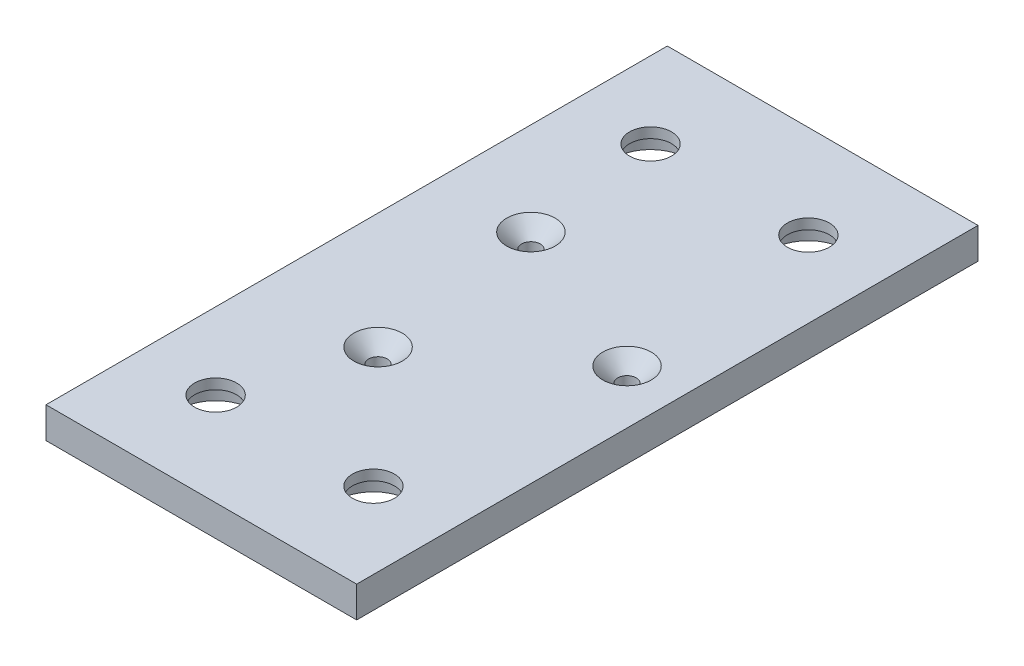
ISO-10303-21;
HEADER;
FILE_DESCRIPTION(('STEP AP214'),'2;1');
FILE_NAME('part.step','',(''),(''),'','','');
FILE_SCHEMA(('AUTOMOTIVE_DESIGN { 1 0 10303 214 1 1 1 1 }'));
ENDSEC;
DATA;
#1=APPLICATION_CONTEXT('core data for automotive mechanical design processes');
#2=APPLICATION_PROTOCOL_DEFINITION('international standard','automotive_design',2000,#1);
#3=PRODUCT_CONTEXT('',#1,'mechanical');
#4=PRODUCT('Part','Part','',(#3));
#5=PRODUCT_RELATED_PRODUCT_CATEGORY('part','',(#4));
#6=PRODUCT_DEFINITION_FORMATION('','',#4);
#7=PRODUCT_DEFINITION_CONTEXT('part definition',#1,'design');
#8=PRODUCT_DEFINITION('design','',#6,#7);
#9=PRODUCT_DEFINITION_SHAPE('','',#8);
#10=(LENGTH_UNIT() NAMED_UNIT(*) SI_UNIT(.MILLI.,.METRE.));
#11=(NAMED_UNIT(*) PLANE_ANGLE_UNIT() SI_UNIT($,.RADIAN.));
#12=(NAMED_UNIT(*) SI_UNIT($,.STERADIAN.) SOLID_ANGLE_UNIT());
#13=UNCERTAINTY_MEASURE_WITH_UNIT(LENGTH_MEASURE(1.E-05),#10,'distance_accuracy_value','');
#14=(GEOMETRIC_REPRESENTATION_CONTEXT(3) GLOBAL_UNCERTAINTY_ASSIGNED_CONTEXT((#13)) GLOBAL_UNIT_ASSIGNED_CONTEXT((#10,
#11,#12)) REPRESENTATION_CONTEXT('',''));
#15=CARTESIAN_POINT('',(0.,0.,0.));
#16=DIRECTION('',(0.,0.,1.));
#17=DIRECTION('',(1.,0.,0.));
#18=AXIS2_PLACEMENT_3D('',#15,#16,#17);
#19=CARTESIAN_POINT('',(25.,5.,50.));
#20=DIRECTION('',(-1.,0.,0.));
#21=DIRECTION('',(0.,0.,1.));
#22=AXIS2_PLACEMENT_3D('',#19,#20,#21);
#23=PLANE('',#22);
#24=DIRECTION('',(0.,0.,-1.));
#25=VECTOR('',#24,1.);
#26=CARTESIAN_POINT('',(25.,0.,50.));
#27=LINE('',#26,#25);
#28=CARTESIAN_POINT('',(25.,0.,50.));
#29=VERTEX_POINT('',#28);
#30=CARTESIAN_POINT('',(25.,0.,-50.));
#31=VERTEX_POINT('',#30);
#32=EDGE_CURVE('E100',#29,#31,#27,.T.);
#33=ORIENTED_EDGE('',*,*,#32,.T.);
#34=DIRECTION('',(0.,-1.,0.));
#35=VECTOR('',#34,1.);
#36=CARTESIAN_POINT('',(25.,5.,-50.));
#37=LINE('',#36,#35);
#38=CARTESIAN_POINT('',(25.,5.,-50.));
#39=VERTEX_POINT('',#38);
#40=EDGE_CURVE('E91',#39,#31,#37,.T.);
#41=ORIENTED_EDGE('',*,*,#40,.F.);
#42=DIRECTION('',(0.,0.,-1.));
#43=VECTOR('',#42,1.);
#44=CARTESIAN_POINT('',(25.,5.,50.));
#45=LINE('',#44,#43);
#46=CARTESIAN_POINT('',(25.,5.,50.));
#47=VERTEX_POINT('',#46);
#48=EDGE_CURVE('E85',#47,#39,#45,.T.);
#49=ORIENTED_EDGE('',*,*,#48,.F.);
#50=DIRECTION('',(0.,-1.,0.));
#51=VECTOR('',#50,1.);
#52=CARTESIAN_POINT('',(25.,5.,50.));
#53=LINE('',#52,#51);
#54=EDGE_CURVE('E96',#47,#29,#53,.T.);
#55=ORIENTED_EDGE('',*,*,#54,.T.);
#56=EDGE_LOOP('',(#33,#41,#49,#55));
#57=FACE_BOUND('',#56,.T.);
#58=ADVANCED_FACE('F32',(#57),#23,.F.);
#59=CARTESIAN_POINT('',(-25.,5.,-50.));
#60=DIRECTION('',(0.,0.,1.));
#61=DIRECTION('',(1.,0.,0.));
#62=AXIS2_PLACEMENT_3D('',#59,#60,#61);
#63=PLANE('',#62);
#64=DIRECTION('',(-1.,0.,0.));
#65=VECTOR('',#64,1.);
#66=CARTESIAN_POINT('',(-25.,0.,-50.));
#67=LINE('',#66,#65);
#68=CARTESIAN_POINT('',(-25.,0.,-50.));
#69=VERTEX_POINT('',#68);
#70=EDGE_CURVE('E90',#31,#69,#67,.T.);
#71=ORIENTED_EDGE('',*,*,#70,.T.);
#72=DIRECTION('',(0.,-1.,0.));
#73=VECTOR('',#72,1.);
#74=CARTESIAN_POINT('',(-25.,5.,-50.));
#75=LINE('',#74,#73);
#76=CARTESIAN_POINT('',(-25.,5.,-50.));
#77=VERTEX_POINT('',#76);
#78=EDGE_CURVE('E88',#77,#69,#75,.T.);
#79=ORIENTED_EDGE('',*,*,#78,.F.);
#80=DIRECTION('',(-1.,0.,0.));
#81=VECTOR('',#80,1.);
#82=CARTESIAN_POINT('',(-25.,5.,-50.));
#83=LINE('',#82,#81);
#84=EDGE_CURVE('E80',#39,#77,#83,.T.);
#85=ORIENTED_EDGE('',*,*,#84,.F.);
#86=ORIENTED_EDGE('',*,*,#40,.T.);
#87=EDGE_LOOP('',(#71,#79,#85,#86));
#88=FACE_BOUND('',#87,.T.);
#89=ADVANCED_FACE('F89',(#88),#63,.F.);
#90=CARTESIAN_POINT('',(-25.,5.,50.));
#91=DIRECTION('',(1.,0.,0.));
#92=DIRECTION('',(0.,0.,-1.));
#93=AXIS2_PLACEMENT_3D('',#90,#91,#92);
#94=PLANE('',#93);
#95=DIRECTION('',(0.,0.,1.));
#96=VECTOR('',#95,1.);
#97=CARTESIAN_POINT('',(-25.,0.,50.));
#98=LINE('',#97,#96);
#99=CARTESIAN_POINT('',(-25.,0.,50.));
#100=VERTEX_POINT('',#99);
#101=EDGE_CURVE('E66',#69,#100,#98,.T.);
#102=ORIENTED_EDGE('',*,*,#101,.T.);
#103=DIRECTION('',(0.,-1.,0.));
#104=VECTOR('',#103,1.);
#105=CARTESIAN_POINT('',(-25.,5.,50.));
#106=LINE('',#105,#104);
#107=CARTESIAN_POINT('',(-25.,5.,50.));
#108=VERTEX_POINT('',#107);
#109=EDGE_CURVE('E92',#108,#100,#106,.T.);
#110=ORIENTED_EDGE('',*,*,#109,.F.);
#111=DIRECTION('',(0.,0.,1.));
#112=VECTOR('',#111,1.);
#113=CARTESIAN_POINT('',(-25.,5.,50.));
#114=LINE('',#113,#112);
#115=EDGE_CURVE('E83',#77,#108,#114,.T.);
#116=ORIENTED_EDGE('',*,*,#115,.F.);
#117=ORIENTED_EDGE('',*,*,#78,.T.);
#118=EDGE_LOOP('',(#102,#110,#116,#117));
#119=FACE_BOUND('',#118,.T.);
#120=ADVANCED_FACE('F94',(#119),#94,.F.);
#121=CARTESIAN_POINT('',(-25.,5.,50.));
#122=DIRECTION('',(0.,0.,-1.));
#123=DIRECTION('',(-1.,0.,0.));
#124=AXIS2_PLACEMENT_3D('',#121,#122,#123);
#125=PLANE('',#124);
#126=DIRECTION('',(1.,0.,0.));
#127=VECTOR('',#126,1.);
#128=CARTESIAN_POINT('',(-25.,0.,50.));
#129=LINE('',#128,#127);
#130=EDGE_CURVE('E72',#100,#29,#129,.T.);
#131=ORIENTED_EDGE('',*,*,#130,.T.);
#132=ORIENTED_EDGE('',*,*,#54,.F.);
#133=DIRECTION('',(1.,0.,0.));
#134=VECTOR('',#133,1.);
#135=CARTESIAN_POINT('',(-25.,5.,50.));
#136=LINE('',#135,#134);
#137=EDGE_CURVE('E49',#108,#47,#136,.T.);
#138=ORIENTED_EDGE('',*,*,#137,.F.);
#139=ORIENTED_EDGE('',*,*,#109,.T.);
#140=EDGE_LOOP('',(#131,#132,#138,#139));
#141=FACE_BOUND('',#140,.T.);
#142=ADVANCED_FACE('F151',(#141),#125,.F.);
#143=CARTESIAN_POINT('',(0.,5.,0.));
#144=DIRECTION('',(0.,-1.,0.));
#145=DIRECTION('',(0.,0.,-1.));
#146=AXIS2_PLACEMENT_3D('',#143,#144,#145);
#147=PLANE('',#146);
#148=CARTESIAN_POINT('',(-12.7,5.,35.));
#149=DIRECTION('',(0.,-1.,0.));
#150=DIRECTION('',(0.,0.,-1.));
#151=AXIS2_PLACEMENT_3D('',#148,#149,#150);
#152=CIRCLE('',#151,3.3782);
#153=CARTESIAN_POINT('',(-12.7,5.,31.6218));
#154=VERTEX_POINT('',#153);
#155=EDGE_CURVE('E231',#154,#154,#152,.T.);
#156=ORIENTED_EDGE('',*,*,#155,.T.);
#157=EDGE_LOOP('',(#156));
#158=FACE_BOUND('',#157,.T.);
#159=CARTESIAN_POINT('',(12.7,5.,35.));
#160=DIRECTION('',(0.,-1.,0.));
#161=DIRECTION('',(0.,0.,-1.));
#162=AXIS2_PLACEMENT_3D('',#159,#160,#161);
#163=CIRCLE('',#162,3.3782);
#164=CARTESIAN_POINT('',(12.7,5.,31.6218));
#165=VERTEX_POINT('',#164);
#166=EDGE_CURVE('E243',#165,#165,#163,.T.);
#167=ORIENTED_EDGE('',*,*,#166,.T.);
#168=EDGE_LOOP('',(#167));
#169=FACE_BOUND('',#168,.T.);
#170=CARTESIAN_POINT('',(12.7,5.,-35.));
#171=DIRECTION('',(0.,-1.,0.));
#172=DIRECTION('',(0.,0.,-1.));
#173=AXIS2_PLACEMENT_3D('',#170,#171,#172);
#174=CIRCLE('',#173,3.3782);
#175=CARTESIAN_POINT('',(12.7,5.,-38.3782));
#176=VERTEX_POINT('',#175);
#177=EDGE_CURVE('E255',#176,#176,#174,.T.);
#178=ORIENTED_EDGE('',*,*,#177,.T.);
#179=EDGE_LOOP('',(#178));
#180=FACE_BOUND('',#179,.T.);
#181=CARTESIAN_POINT('',(-12.7,5.,-35.));
#182=DIRECTION('',(0.,-1.,0.));
#183=DIRECTION('',(0.,0.,-1.));
#184=AXIS2_PLACEMENT_3D('',#181,#182,#183);
#185=CIRCLE('',#184,3.3782);
#186=CARTESIAN_POINT('',(-12.7,5.,-38.3782));
#187=VERTEX_POINT('',#186);
#188=EDGE_CURVE('E267',#187,#187,#185,.T.);
#189=ORIENTED_EDGE('',*,*,#188,.T.);
#190=EDGE_LOOP('',(#189));
#191=FACE_BOUND('',#190,.T.);
#192=CARTESIAN_POINT('',(-6.31427663402399,5.,15.2440122864362));
#193=DIRECTION('',(0.,-1.,0.));
#194=DIRECTION('',(0.,0.,-1.));
#195=AXIS2_PLACEMENT_3D('',#192,#193,#194);
#196=CIRCLE('',#195,3.90000000000003);
#197=CARTESIAN_POINT('',(-6.31427663402399,5.,11.3440122864362));
#198=VERTEX_POINT('',#197);
#199=EDGE_CURVE('E119',#198,#198,#196,.T.);
#200=ORIENTED_EDGE('',*,*,#199,.T.);
#201=EDGE_LOOP('',(#200));
#202=FACE_BOUND('',#201,.T.);
#203=CARTESIAN_POINT('',(16.3588402126679,5.,-2.15368217163092));
#204=DIRECTION('',(0.,-1.,0.));
#205=DIRECTION('',(0.,0.,-1.));
#206=AXIS2_PLACEMENT_3D('',#203,#204,#205);
#207=CIRCLE('',#206,3.90000000000003);
#208=CARTESIAN_POINT('',(16.3588402126679,5.,-6.05368217163095));
#209=VERTEX_POINT('',#208);
#210=EDGE_CURVE('E116',#209,#209,#207,.T.);
#211=ORIENTED_EDGE('',*,*,#210,.T.);
#212=EDGE_LOOP('',(#211));
#213=FACE_BOUND('',#212,.T.);
#214=CARTESIAN_POINT('',(-10.0445635786438,5.,-13.0903301148054));
#215=DIRECTION('',(0.,-1.,0.));
#216=DIRECTION('',(0.,0.,-1.));
#217=AXIS2_PLACEMENT_3D('',#214,#215,#216);
#218=CIRCLE('',#217,3.90000000000003);
#219=CARTESIAN_POINT('',(-10.0445635786438,5.,-16.9903301148055));
#220=VERTEX_POINT('',#219);
#221=EDGE_CURVE('E113',#220,#220,#218,.T.);
#222=ORIENTED_EDGE('',*,*,#221,.T.);
#223=EDGE_LOOP('',(#222));
#224=FACE_BOUND('',#223,.T.);
#225=ORIENTED_EDGE('',*,*,#48,.T.);
#226=ORIENTED_EDGE('',*,*,#84,.T.);
#227=ORIENTED_EDGE('',*,*,#115,.T.);
#228=ORIENTED_EDGE('',*,*,#137,.T.);
#229=EDGE_LOOP('',(#225,#226,#227,#228));
#230=FACE_BOUND('',#229,.T.);
#231=ADVANCED_FACE('F81',(#158,#169,#180,#191,#202,#213,#224,#230),#147,.F.);
#232=CARTESIAN_POINT('',(0.,0.,0.));
#233=DIRECTION('',(0.,-1.,0.));
#234=DIRECTION('',(0.,0.,-1.));
#235=AXIS2_PLACEMENT_3D('',#232,#233,#234);
#236=PLANE('',#235);
#237=CARTESIAN_POINT('',(-12.7,0.,35.));
#238=DIRECTION('',(0.,-1.,0.));
#239=DIRECTION('',(0.,0.,-1.));
#240=AXIS2_PLACEMENT_3D('',#237,#238,#239);
#241=CIRCLE('',#240,5.95376);
#242=CARTESIAN_POINT('',(-12.7,0.,29.04624));
#243=VERTEX_POINT('',#242);
#244=EDGE_CURVE('E224',#243,#243,#241,.T.);
#245=ORIENTED_EDGE('',*,*,#244,.F.);
#246=EDGE_LOOP('',(#245));
#247=FACE_BOUND('',#246,.T.);
#248=CARTESIAN_POINT('',(12.7,0.,35.));
#249=DIRECTION('',(0.,-1.,0.));
#250=DIRECTION('',(0.,0.,-1.));
#251=AXIS2_PLACEMENT_3D('',#248,#249,#250);
#252=CIRCLE('',#251,5.95376);
#253=CARTESIAN_POINT('',(12.7,0.,29.04624));
#254=VERTEX_POINT('',#253);
#255=EDGE_CURVE('E234',#254,#254,#252,.T.);
#256=ORIENTED_EDGE('',*,*,#255,.F.);
#257=EDGE_LOOP('',(#256));
#258=FACE_BOUND('',#257,.T.);
#259=CARTESIAN_POINT('',(12.7,0.,-35.));
#260=DIRECTION('',(0.,-1.,0.));
#261=DIRECTION('',(0.,0.,-1.));
#262=AXIS2_PLACEMENT_3D('',#259,#260,#261);
#263=CIRCLE('',#262,5.95376);
#264=CARTESIAN_POINT('',(12.7,0.,-40.95376));
#265=VERTEX_POINT('',#264);
#266=EDGE_CURVE('E246',#265,#265,#263,.T.);
#267=ORIENTED_EDGE('',*,*,#266,.F.);
#268=EDGE_LOOP('',(#267));
#269=FACE_BOUND('',#268,.T.);
#270=CARTESIAN_POINT('',(-12.7,0.,-35.));
#271=DIRECTION('',(0.,-1.,0.));
#272=DIRECTION('',(0.,0.,-1.));
#273=AXIS2_PLACEMENT_3D('',#270,#271,#272);
#274=CIRCLE('',#273,5.95376);
#275=CARTESIAN_POINT('',(-12.7,0.,-40.95376));
#276=VERTEX_POINT('',#275);
#277=EDGE_CURVE('E258',#276,#276,#274,.T.);
#278=ORIENTED_EDGE('',*,*,#277,.F.);
#279=EDGE_LOOP('',(#278));
#280=FACE_BOUND('',#279,.T.);
#281=CARTESIAN_POINT('',(-10.0445635786438,0.,-13.0903301148054));
#282=DIRECTION('',(0.,1.,0.));
#283=DIRECTION('',(0.,0.,1.));
#284=AXIS2_PLACEMENT_3D('',#281,#282,#283);
#285=CIRCLE('',#284,1.5);
#286=CARTESIAN_POINT('',(-10.0445635786438,0.,-11.5903301148054));
#287=VERTEX_POINT('',#286);
#288=EDGE_CURVE('E270',#287,#287,#285,.T.);
#289=ORIENTED_EDGE('',*,*,#288,.T.);
#290=EDGE_LOOP('',(#289));
#291=FACE_BOUND('',#290,.T.);
#292=CARTESIAN_POINT('',(16.3588402126679,0.,-2.15368217163092));
#293=DIRECTION('',(0.,1.,0.));
#294=DIRECTION('',(0.,0.,1.));
#295=AXIS2_PLACEMENT_3D('',#292,#293,#294);
#296=CIRCLE('',#295,1.5);
#297=CARTESIAN_POINT('',(16.3588402126679,0.,-0.653682171630918));
#298=VERTEX_POINT('',#297);
#299=EDGE_CURVE('E273',#298,#298,#296,.T.);
#300=ORIENTED_EDGE('',*,*,#299,.T.);
#301=EDGE_LOOP('',(#300));
#302=FACE_BOUND('',#301,.T.);
#303=CARTESIAN_POINT('',(-6.31427663402399,0.,15.2440122864362));
#304=DIRECTION('',(0.,1.,0.));
#305=DIRECTION('',(0.,0.,1.));
#306=AXIS2_PLACEMENT_3D('',#303,#304,#305);
#307=CIRCLE('',#306,1.5);
#308=CARTESIAN_POINT('',(-6.31427663402399,0.,16.7440122864362));
#309=VERTEX_POINT('',#308);
#310=EDGE_CURVE('E103',#309,#309,#307,.T.);
#311=ORIENTED_EDGE('',*,*,#310,.T.);
#312=EDGE_LOOP('',(#311));
#313=FACE_BOUND('',#312,.T.);
#314=ORIENTED_EDGE('',*,*,#32,.F.);
#315=ORIENTED_EDGE('',*,*,#130,.F.);
#316=ORIENTED_EDGE('',*,*,#101,.F.);
#317=ORIENTED_EDGE('',*,*,#70,.F.);
#318=EDGE_LOOP('',(#314,#315,#316,#317));
#319=FACE_BOUND('',#318,.T.);
#320=ADVANCED_FACE('F154',(#247,#258,#269,#280,#291,#302,#313,#319),#236,.T.);
#321=CARTESIAN_POINT('',(-6.31427663402399,0.,15.2440122864362));
#322=DIRECTION('',(0.,1.,0.));
#323=DIRECTION('',(0.,0.,1.));
#324=AXIS2_PLACEMENT_3D('',#321,#322,#323);
#325=CYLINDRICAL_SURFACE('',#324,1.5);
#326=CARTESIAN_POINT('',(-6.31427663402399,2.59999999999999,15.2440122864362));
#327=DIRECTION('',(0.,-1.,0.));
#328=DIRECTION('',(0.,0.,-1.));
#329=AXIS2_PLACEMENT_3D('',#326,#327,#328);
#330=CIRCLE('',#329,1.5);
#331=CARTESIAN_POINT('',(-6.31427663402399,2.59999999999999,13.7440122864362));
#332=VERTEX_POINT('',#331);
#333=EDGE_CURVE('E110',#332,#332,#330,.F.);
#334=ORIENTED_EDGE('',*,*,#333,.T.);
#335=EDGE_LOOP('',(#334));
#336=FACE_BOUND('',#335,.T.);
#337=ORIENTED_EDGE('',*,*,#310,.F.);
#338=EDGE_LOOP('',(#337));
#339=FACE_BOUND('',#338,.T.);
#340=ADVANCED_FACE('F157',(#336,#339),#325,.F.);
#341=CARTESIAN_POINT('',(16.3588402126679,0.,-2.15368217163092));
#342=DIRECTION('',(0.,1.,0.));
#343=DIRECTION('',(0.,0.,1.));
#344=AXIS2_PLACEMENT_3D('',#341,#342,#343);
#345=CYLINDRICAL_SURFACE('',#344,1.5);
#346=CARTESIAN_POINT('',(16.3588402126679,2.59999999999999,-2.15368217163092));
#347=DIRECTION('',(0.,-1.,0.));
#348=DIRECTION('',(0.,0.,-1.));
#349=AXIS2_PLACEMENT_3D('',#346,#347,#348);
#350=CIRCLE('',#349,1.5);
#351=CARTESIAN_POINT('',(16.3588402126679,2.59999999999999,-3.65368217163092));
#352=VERTEX_POINT('',#351);
#353=EDGE_CURVE('E41',#352,#352,#350,.F.);
#354=ORIENTED_EDGE('',*,*,#353,.T.);
#355=EDGE_LOOP('',(#354));
#356=FACE_BOUND('',#355,.T.);
#357=ORIENTED_EDGE('',*,*,#299,.F.);
#358=EDGE_LOOP('',(#357));
#359=FACE_BOUND('',#358,.T.);
#360=ADVANCED_FACE('F124',(#356,#359),#345,.F.);
#361=CARTESIAN_POINT('',(-10.0445635786438,0.,-13.0903301148054));
#362=DIRECTION('',(0.,1.,0.));
#363=DIRECTION('',(0.,0.,1.));
#364=AXIS2_PLACEMENT_3D('',#361,#362,#363);
#365=CYLINDRICAL_SURFACE('',#364,1.5);
#366=CARTESIAN_POINT('',(-10.0445635786438,2.59999999999999,-13.0903301148054));
#367=DIRECTION('',(0.,-1.,0.));
#368=DIRECTION('',(0.,0.,-1.));
#369=AXIS2_PLACEMENT_3D('',#366,#367,#368);
#370=CIRCLE('',#369,1.5);
#371=CARTESIAN_POINT('',(-10.0445635786438,2.59999999999999,-14.5903301148054));
#372=VERTEX_POINT('',#371);
#373=EDGE_CURVE('E11',#372,#372,#370,.F.);
#374=ORIENTED_EDGE('',*,*,#373,.T.);
#375=EDGE_LOOP('',(#374));
#376=FACE_BOUND('',#375,.T.);
#377=ORIENTED_EDGE('',*,*,#288,.F.);
#378=EDGE_LOOP('',(#377));
#379=FACE_BOUND('',#378,.T.);
#380=ADVANCED_FACE('F137',(#376,#379),#365,.F.);
#381=CARTESIAN_POINT('',(-6.31427663402399,2.59999999999999,15.2440122864362));
#382=DIRECTION('',(0.,1.,0.));
#383=DIRECTION('',(0.,0.,1.));
#384=AXIS2_PLACEMENT_3D('',#381,#382,#383);
#385=CONICAL_SURFACE('',#384,1.5,0.785398163397453);
#386=ORIENTED_EDGE('',*,*,#199,.F.);
#387=EDGE_LOOP('',(#386));
#388=FACE_BOUND('',#387,.T.);
#389=ORIENTED_EDGE('',*,*,#333,.F.);
#390=EDGE_LOOP('',(#389));
#391=FACE_BOUND('',#390,.T.);
#392=ADVANCED_FACE('F129',(#388,#391),#385,.F.);
#393=CARTESIAN_POINT('',(16.3588402126679,2.59999999999999,-2.15368217163092));
#394=DIRECTION('',(0.,1.,0.));
#395=DIRECTION('',(0.,0.,1.));
#396=AXIS2_PLACEMENT_3D('',#393,#394,#395);
#397=CONICAL_SURFACE('',#396,1.5,0.785398163397453);
#398=ORIENTED_EDGE('',*,*,#210,.F.);
#399=EDGE_LOOP('',(#398));
#400=FACE_BOUND('',#399,.T.);
#401=ORIENTED_EDGE('',*,*,#353,.F.);
#402=EDGE_LOOP('',(#401));
#403=FACE_BOUND('',#402,.T.);
#404=ADVANCED_FACE('F127',(#400,#403),#397,.F.);
#405=CARTESIAN_POINT('',(-10.0445635786438,2.59999999999999,-13.0903301148054));
#406=DIRECTION('',(0.,1.,0.));
#407=DIRECTION('',(0.,0.,1.));
#408=AXIS2_PLACEMENT_3D('',#405,#406,#407);
#409=CONICAL_SURFACE('',#408,1.5,0.785398163397452);
#410=ORIENTED_EDGE('',*,*,#221,.F.);
#411=EDGE_LOOP('',(#410));
#412=FACE_BOUND('',#411,.T.);
#413=ORIENTED_EDGE('',*,*,#373,.F.);
#414=EDGE_LOOP('',(#413));
#415=FACE_BOUND('',#414,.T.);
#416=ADVANCED_FACE('F34',(#412,#415),#409,.F.);
#417=CARTESIAN_POINT('',(-12.7,0.,-35.));
#418=DIRECTION('',(0.,-1.,0.));
#419=DIRECTION('',(0.,0.,-1.));
#420=AXIS2_PLACEMENT_3D('',#417,#418,#419);
#421=CYLINDRICAL_SURFACE('',#420,3.3782);
#422=ORIENTED_EDGE('',*,*,#188,.F.);
#423=EDGE_LOOP('',(#422));
#424=FACE_BOUND('',#423,.T.);
#425=CARTESIAN_POINT('',(-12.7,3.3528,-35.));
#426=DIRECTION('',(0.,-1.,0.));
#427=DIRECTION('',(0.,0.,-1.));
#428=AXIS2_PLACEMENT_3D('',#425,#426,#427);
#429=CIRCLE('',#428,3.3782);
#430=CARTESIAN_POINT('',(-12.7,3.3528,-38.3782));
#431=VERTEX_POINT('',#430);
#432=EDGE_CURVE('E264',#431,#431,#429,.T.);
#433=ORIENTED_EDGE('',*,*,#432,.T.);
#434=EDGE_LOOP('',(#433));
#435=FACE_BOUND('',#434,.T.);
#436=ADVANCED_FACE('F135',(#424,#435),#421,.F.);
#437=CARTESIAN_POINT('',(-9.3218,3.3528,-35.));
#438=DIRECTION('',(0.,1.,0.));
#439=DIRECTION('',(0.,0.,1.));
#440=AXIS2_PLACEMENT_3D('',#437,#438,#439);
#441=PLANE('',#440);
#442=ORIENTED_EDGE('',*,*,#432,.F.);
#443=EDGE_LOOP('',(#442));
#444=FACE_BOUND('',#443,.T.);
#445=CARTESIAN_POINT('',(-12.7,3.3528,-35.));
#446=DIRECTION('',(0.,-1.,0.));
#447=DIRECTION('',(0.,0.,-1.));
#448=AXIS2_PLACEMENT_3D('',#445,#446,#447);
#449=CIRCLE('',#448,5.95376);
#450=CARTESIAN_POINT('',(-12.7,3.3528,-40.95376));
#451=VERTEX_POINT('',#450);
#452=EDGE_CURVE('E261',#451,#451,#449,.T.);
#453=ORIENTED_EDGE('',*,*,#452,.T.);
#454=EDGE_LOOP('',(#453));
#455=FACE_BOUND('',#454,.T.);
#456=ADVANCED_FACE('F172',(#444,#455),#441,.F.);
#457=CARTESIAN_POINT('',(-12.7,0.,-35.));
#458=DIRECTION('',(0.,-1.,0.));
#459=DIRECTION('',(0.,0.,-1.));
#460=AXIS2_PLACEMENT_3D('',#457,#458,#459);
#461=CYLINDRICAL_SURFACE('',#460,5.95376);
#462=ORIENTED_EDGE('',*,*,#452,.F.);
#463=EDGE_LOOP('',(#462));
#464=FACE_BOUND('',#463,.T.);
#465=ORIENTED_EDGE('',*,*,#277,.T.);
#466=EDGE_LOOP('',(#465));
#467=FACE_BOUND('',#466,.T.);
#468=ADVANCED_FACE('F176',(#464,#467),#461,.F.);
#469=CARTESIAN_POINT('',(12.7,0.,-35.));
#470=DIRECTION('',(0.,-1.,0.));
#471=DIRECTION('',(0.,0.,-1.));
#472=AXIS2_PLACEMENT_3D('',#469,#470,#471);
#473=CYLINDRICAL_SURFACE('',#472,3.3782);
#474=ORIENTED_EDGE('',*,*,#177,.F.);
#475=EDGE_LOOP('',(#474));
#476=FACE_BOUND('',#475,.T.);
#477=CARTESIAN_POINT('',(12.7,3.3528,-35.));
#478=DIRECTION('',(0.,-1.,0.));
#479=DIRECTION('',(0.,0.,-1.));
#480=AXIS2_PLACEMENT_3D('',#477,#478,#479);
#481=CIRCLE('',#480,3.3782);
#482=CARTESIAN_POINT('',(12.7,3.3528,-38.3782));
#483=VERTEX_POINT('',#482);
#484=EDGE_CURVE('E252',#483,#483,#481,.T.);
#485=ORIENTED_EDGE('',*,*,#484,.T.);
#486=EDGE_LOOP('',(#485));
#487=FACE_BOUND('',#486,.T.);
#488=ADVANCED_FACE('F180',(#476,#487),#473,.F.);
#489=CARTESIAN_POINT('',(16.0782,3.3528,-35.));
#490=DIRECTION('',(0.,1.,0.));
#491=DIRECTION('',(0.,0.,1.));
#492=AXIS2_PLACEMENT_3D('',#489,#490,#491);
#493=PLANE('',#492);
#494=ORIENTED_EDGE('',*,*,#484,.F.);
#495=EDGE_LOOP('',(#494));
#496=FACE_BOUND('',#495,.T.);
#497=CARTESIAN_POINT('',(12.7,3.3528,-35.));
#498=DIRECTION('',(0.,-1.,0.));
#499=DIRECTION('',(0.,0.,-1.));
#500=AXIS2_PLACEMENT_3D('',#497,#498,#499);
#501=CIRCLE('',#500,5.95376);
#502=CARTESIAN_POINT('',(12.7,3.3528,-40.95376));
#503=VERTEX_POINT('',#502);
#504=EDGE_CURVE('E249',#503,#503,#501,.T.);
#505=ORIENTED_EDGE('',*,*,#504,.T.);
#506=EDGE_LOOP('',(#505));
#507=FACE_BOUND('',#506,.T.);
#508=ADVANCED_FACE('F184',(#496,#507),#493,.F.);
#509=CARTESIAN_POINT('',(12.7,0.,-35.));
#510=DIRECTION('',(0.,-1.,0.));
#511=DIRECTION('',(0.,0.,-1.));
#512=AXIS2_PLACEMENT_3D('',#509,#510,#511);
#513=CYLINDRICAL_SURFACE('',#512,5.95376);
#514=ORIENTED_EDGE('',*,*,#504,.F.);
#515=EDGE_LOOP('',(#514));
#516=FACE_BOUND('',#515,.T.);
#517=ORIENTED_EDGE('',*,*,#266,.T.);
#518=EDGE_LOOP('',(#517));
#519=FACE_BOUND('',#518,.T.);
#520=ADVANCED_FACE('F188',(#516,#519),#513,.F.);
#521=CARTESIAN_POINT('',(12.7,0.,35.));
#522=DIRECTION('',(0.,-1.,0.));
#523=DIRECTION('',(0.,0.,-1.));
#524=AXIS2_PLACEMENT_3D('',#521,#522,#523);
#525=CYLINDRICAL_SURFACE('',#524,3.3782);
#526=ORIENTED_EDGE('',*,*,#166,.F.);
#527=EDGE_LOOP('',(#526));
#528=FACE_BOUND('',#527,.T.);
#529=CARTESIAN_POINT('',(12.7,3.3528,35.));
#530=DIRECTION('',(0.,-1.,0.));
#531=DIRECTION('',(0.,0.,-1.));
#532=AXIS2_PLACEMENT_3D('',#529,#530,#531);
#533=CIRCLE('',#532,3.3782);
#534=CARTESIAN_POINT('',(12.7,3.3528,31.6218));
#535=VERTEX_POINT('',#534);
#536=EDGE_CURVE('E240',#535,#535,#533,.T.);
#537=ORIENTED_EDGE('',*,*,#536,.T.);
#538=EDGE_LOOP('',(#537));
#539=FACE_BOUND('',#538,.T.);
#540=ADVANCED_FACE('F192',(#528,#539),#525,.F.);
#541=CARTESIAN_POINT('',(16.0782,3.3528,35.));
#542=DIRECTION('',(0.,1.,0.));
#543=DIRECTION('',(0.,0.,1.));
#544=AXIS2_PLACEMENT_3D('',#541,#542,#543);
#545=PLANE('',#544);
#546=ORIENTED_EDGE('',*,*,#536,.F.);
#547=EDGE_LOOP('',(#546));
#548=FACE_BOUND('',#547,.T.);
#549=CARTESIAN_POINT('',(12.7,3.3528,35.));
#550=DIRECTION('',(0.,-1.,0.));
#551=DIRECTION('',(0.,0.,-1.));
#552=AXIS2_PLACEMENT_3D('',#549,#550,#551);
#553=CIRCLE('',#552,5.95376);
#554=CARTESIAN_POINT('',(12.7,3.3528,29.04624));
#555=VERTEX_POINT('',#554);
#556=EDGE_CURVE('E237',#555,#555,#553,.T.);
#557=ORIENTED_EDGE('',*,*,#556,.T.);
#558=EDGE_LOOP('',(#557));
#559=FACE_BOUND('',#558,.T.);
#560=ADVANCED_FACE('F196',(#548,#559),#545,.F.);
#561=CARTESIAN_POINT('',(12.7,0.,35.));
#562=DIRECTION('',(0.,-1.,0.));
#563=DIRECTION('',(0.,0.,-1.));
#564=AXIS2_PLACEMENT_3D('',#561,#562,#563);
#565=CYLINDRICAL_SURFACE('',#564,5.95376);
#566=ORIENTED_EDGE('',*,*,#556,.F.);
#567=EDGE_LOOP('',(#566));
#568=FACE_BOUND('',#567,.T.);
#569=ORIENTED_EDGE('',*,*,#255,.T.);
#570=EDGE_LOOP('',(#569));
#571=FACE_BOUND('',#570,.T.);
#572=ADVANCED_FACE('F200',(#568,#571),#565,.F.);
#573=CARTESIAN_POINT('',(-12.7,0.,35.));
#574=DIRECTION('',(0.,-1.,0.));
#575=DIRECTION('',(0.,0.,-1.));
#576=AXIS2_PLACEMENT_3D('',#573,#574,#575);
#577=CYLINDRICAL_SURFACE('',#576,3.3782);
#578=ORIENTED_EDGE('',*,*,#155,.F.);
#579=EDGE_LOOP('',(#578));
#580=FACE_BOUND('',#579,.T.);
#581=CARTESIAN_POINT('',(-12.7,3.3528,35.));
#582=DIRECTION('',(0.,-1.,0.));
#583=DIRECTION('',(0.,0.,-1.));
#584=AXIS2_PLACEMENT_3D('',#581,#582,#583);
#585=CIRCLE('',#584,3.3782);
#586=CARTESIAN_POINT('',(-12.7,3.3528,31.6218));
#587=VERTEX_POINT('',#586);
#588=EDGE_CURVE('E226',#587,#587,#585,.T.);
#589=ORIENTED_EDGE('',*,*,#588,.T.);
#590=EDGE_LOOP('',(#589));
#591=FACE_BOUND('',#590,.T.);
#592=ADVANCED_FACE('F204',(#580,#591),#577,.F.);
#593=CARTESIAN_POINT('',(-9.3218,3.3528,35.));
#594=DIRECTION('',(0.,1.,0.));
#595=DIRECTION('',(0.,0.,1.));
#596=AXIS2_PLACEMENT_3D('',#593,#594,#595);
#597=PLANE('',#596);
#598=ORIENTED_EDGE('',*,*,#588,.F.);
#599=EDGE_LOOP('',(#598));
#600=FACE_BOUND('',#599,.T.);
#601=CARTESIAN_POINT('',(-12.7,3.3528,35.));
#602=DIRECTION('',(0.,-1.,0.));
#603=DIRECTION('',(0.,0.,-1.));
#604=AXIS2_PLACEMENT_3D('',#601,#602,#603);
#605=CIRCLE('',#604,5.95376);
#606=CARTESIAN_POINT('',(-12.7,3.3528,29.04624));
#607=VERTEX_POINT('',#606);
#608=EDGE_CURVE('E221',#607,#607,#605,.T.);
#609=ORIENTED_EDGE('',*,*,#608,.T.);
#610=EDGE_LOOP('',(#609));
#611=FACE_BOUND('',#610,.T.);
#612=ADVANCED_FACE('F208',(#600,#611),#597,.F.);
#613=CARTESIAN_POINT('',(-12.7,0.,35.));
#614=DIRECTION('',(0.,-1.,0.));
#615=DIRECTION('',(0.,0.,-1.));
#616=AXIS2_PLACEMENT_3D('',#613,#614,#615);
#617=CYLINDRICAL_SURFACE('',#616,5.95376);
#618=ORIENTED_EDGE('',*,*,#608,.F.);
#619=EDGE_LOOP('',(#618));
#620=FACE_BOUND('',#619,.T.);
#621=ORIENTED_EDGE('',*,*,#244,.T.);
#622=EDGE_LOOP('',(#621));
#623=FACE_BOUND('',#622,.T.);
#624=ADVANCED_FACE('F212',(#620,#623),#617,.F.);
#625=CLOSED_SHELL('',(#58,#89,#120,#142,#231,#320,#340,#360,#380,#392,#404,#416,#436,#456,#468,
#488,#508,#520,#540,#560,#572,#592,#612,#624));
#626=MANIFOLD_SOLID_BREP('B2',#625);
#627=ADVANCED_BREP_SHAPE_REPRESENTATION('',(#18,#626),#14);
#628=SHAPE_DEFINITION_REPRESENTATION(#9,#627);
ENDSEC;
END-ISO-10303-21;
